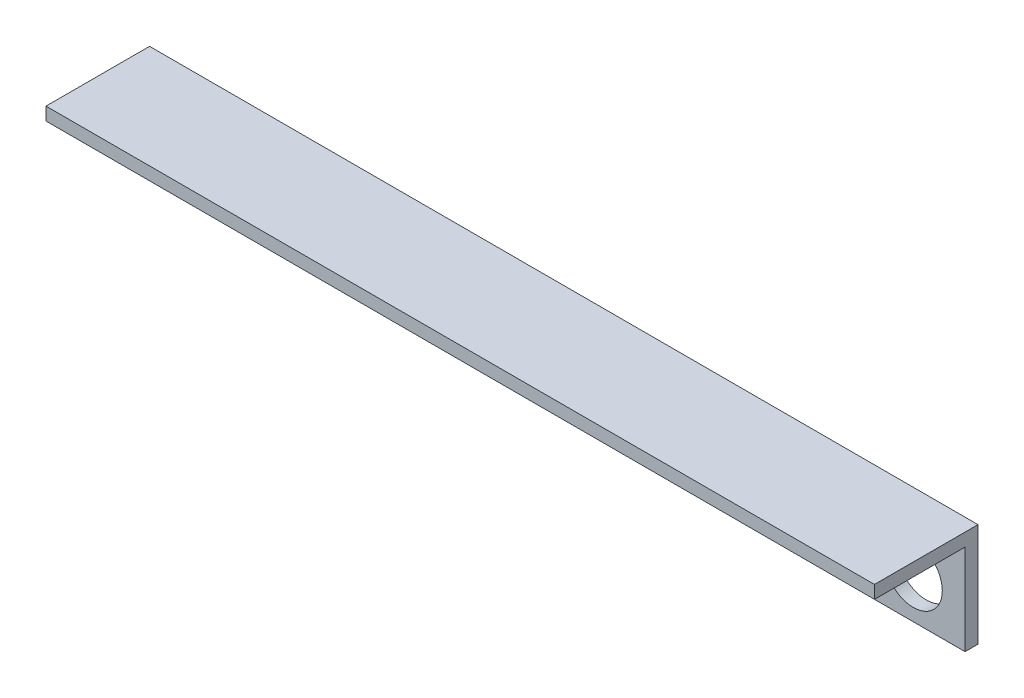
ISO-10303-21;
HEADER;
FILE_DESCRIPTION(('STEP AP214'),'2;1');
FILE_NAME('part.step','',(''),(''),'','','');
FILE_SCHEMA(('AUTOMOTIVE_DESIGN { 1 0 10303 214 1 1 1 1 }'));
ENDSEC;
DATA;
#1=APPLICATION_CONTEXT('core data for automotive mechanical design processes');
#2=APPLICATION_PROTOCOL_DEFINITION('international standard','automotive_design',2000,#1);
#3=PRODUCT_CONTEXT('',#1,'mechanical');
#4=PRODUCT('Part','Part','',(#3));
#5=PRODUCT_RELATED_PRODUCT_CATEGORY('part','',(#4));
#6=PRODUCT_DEFINITION_FORMATION('','',#4);
#7=PRODUCT_DEFINITION_CONTEXT('part definition',#1,'design');
#8=PRODUCT_DEFINITION('design','',#6,#7);
#9=PRODUCT_DEFINITION_SHAPE('','',#8);
#10=(LENGTH_UNIT() NAMED_UNIT(*) SI_UNIT(.MILLI.,.METRE.));
#11=(NAMED_UNIT(*) PLANE_ANGLE_UNIT() SI_UNIT($,.RADIAN.));
#12=(NAMED_UNIT(*) SI_UNIT($,.STERADIAN.) SOLID_ANGLE_UNIT());
#13=UNCERTAINTY_MEASURE_WITH_UNIT(LENGTH_MEASURE(1.E-05),#10,'distance_accuracy_value','');
#14=(GEOMETRIC_REPRESENTATION_CONTEXT(3) GLOBAL_UNCERTAINTY_ASSIGNED_CONTEXT((#13)) GLOBAL_UNIT_ASSIGNED_CONTEXT((#10,
#11,#12)) REPRESENTATION_CONTEXT('',''));
#15=CARTESIAN_POINT('',(0.,0.,0.));
#16=DIRECTION('',(0.,0.,1.));
#17=DIRECTION('',(1.,0.,0.));
#18=AXIS2_PLACEMENT_3D('',#15,#16,#17);
#19=CARTESIAN_POINT('',(-44.45,0.,1.5875));
#20=DIRECTION('',(0.,-1.,0.));
#21=DIRECTION('',(0.,0.,-1.));
#22=AXIS2_PLACEMENT_3D('',#19,#20,#21);
#23=PLANE('',#22);
#24=DIRECTION('',(1.,0.,0.));
#25=VECTOR('',#24,1.);
#26=CARTESIAN_POINT('',(-44.45,0.,0.));
#27=LINE('',#26,#25);
#28=CARTESIAN_POINT('',(-44.45,0.,0.));
#29=VERTEX_POINT('',#28);
#30=CARTESIAN_POINT('',(57.15,0.,0.));
#31=VERTEX_POINT('',#30);
#32=EDGE_CURVE('E41',#29,#31,#27,.T.);
#33=ORIENTED_EDGE('',*,*,#32,.T.);
#34=DIRECTION('',(0.,0.,-1.));
#35=VECTOR('',#34,1.);
#36=CARTESIAN_POINT('',(57.15,0.,1.5875));
#37=LINE('',#36,#35);
#38=CARTESIAN_POINT('',(57.15,0.,1.5875));
#39=VERTEX_POINT('',#38);
#40=EDGE_CURVE('E90',#39,#31,#37,.T.);
#41=ORIENTED_EDGE('',*,*,#40,.F.);
#42=DIRECTION('',(1.,0.,0.));
#43=VECTOR('',#42,1.);
#44=CARTESIAN_POINT('',(-44.45,0.,1.5875));
#45=LINE('',#44,#43);
#46=CARTESIAN_POINT('',(-44.45,0.,1.5875));
#47=VERTEX_POINT('',#46);
#48=EDGE_CURVE('E11',#47,#39,#45,.T.);
#49=ORIENTED_EDGE('',*,*,#48,.F.);
#50=DIRECTION('',(0.,0.,-1.));
#51=VECTOR('',#50,1.);
#52=CARTESIAN_POINT('',(-44.45,0.,1.5875));
#53=LINE('',#52,#51);
#54=EDGE_CURVE('E91',#47,#29,#53,.T.);
#55=ORIENTED_EDGE('',*,*,#54,.T.);
#56=EDGE_LOOP('',(#33,#41,#49,#55));
#57=FACE_BOUND('',#56,.T.);
#58=ADVANCED_FACE('F38',(#57),#23,.T.);
#59=CARTESIAN_POINT('',(-44.45,0.,1.5875));
#60=DIRECTION('',(0.,0.,1.));
#61=DIRECTION('',(1.,0.,0.));
#62=AXIS2_PLACEMENT_3D('',#59,#60,#61);
#63=PLANE('',#62);
#64=CARTESIAN_POINT('',(-25.4,5.08000000000001,1.5875));
#65=DIRECTION('',(0.,0.,1.));
#66=DIRECTION('',(1.,0.,0.));
#67=AXIS2_PLACEMENT_3D('',#64,#65,#66);
#68=CIRCLE('',#67,3.556);
#69=CARTESIAN_POINT('',(-21.844,5.08000000000001,1.5875));
#70=VERTEX_POINT('',#69);
#71=EDGE_CURVE('E109',#70,#70,#68,.T.);
#72=ORIENTED_EDGE('',*,*,#71,.F.);
#73=EDGE_LOOP('',(#72));
#74=FACE_BOUND('',#73,.T.);
#75=CARTESIAN_POINT('',(50.8,5.08,1.5875));
#76=DIRECTION('',(0.,0.,1.));
#77=DIRECTION('',(1.,0.,0.));
#78=AXIS2_PLACEMENT_3D('',#75,#76,#77);
#79=CIRCLE('',#78,3.556);
#80=CARTESIAN_POINT('',(54.356,5.08,1.5875));
#81=VERTEX_POINT('',#80);
#82=EDGE_CURVE('E112',#81,#81,#79,.T.);
#83=ORIENTED_EDGE('',*,*,#82,.F.);
#84=EDGE_LOOP('',(#83));
#85=FACE_BOUND('',#84,.T.);
#86=ORIENTED_EDGE('',*,*,#48,.T.);
#87=DIRECTION('',(0.,-1.,0.));
#88=VECTOR('',#87,1.);
#89=CARTESIAN_POINT('',(57.15,0.,1.5875));
#90=LINE('',#89,#88);
#91=CARTESIAN_POINT('',(57.15,11.1125,1.5875));
#92=VERTEX_POINT('',#91);
#93=EDGE_CURVE('E108',#92,#39,#90,.T.);
#94=ORIENTED_EDGE('',*,*,#93,.F.);
#95=DIRECTION('',(1.,0.,0.));
#96=VECTOR('',#95,1.);
#97=CARTESIAN_POINT('',(-44.45,11.1125,1.5875));
#98=LINE('',#97,#96);
#99=CARTESIAN_POINT('',(-44.45,11.1125,1.5875));
#100=VERTEX_POINT('',#99);
#101=EDGE_CURVE('E46',#100,#92,#98,.T.);
#102=ORIENTED_EDGE('',*,*,#101,.F.);
#103=DIRECTION('',(0.,-1.,0.));
#104=VECTOR('',#103,1.);
#105=CARTESIAN_POINT('',(-44.45,0.,1.5875));
#106=LINE('',#105,#104);
#107=EDGE_CURVE('E96',#100,#47,#106,.T.);
#108=ORIENTED_EDGE('',*,*,#107,.T.);
#109=EDGE_LOOP('',(#86,#94,#102,#108));
#110=FACE_BOUND('',#109,.T.);
#111=ADVANCED_FACE('F153',(#74,#85,#110),#63,.T.);
#112=CARTESIAN_POINT('',(-44.45,11.1125,1.5875));
#113=DIRECTION('',(0.,-1.,0.));
#114=DIRECTION('',(0.,0.,-1.));
#115=AXIS2_PLACEMENT_3D('',#112,#113,#114);
#116=PLANE('',#115);
#117=ORIENTED_EDGE('',*,*,#101,.T.);
#118=DIRECTION('',(0.,0.,-1.));
#119=VECTOR('',#118,1.);
#120=CARTESIAN_POINT('',(57.15,11.1125,1.5875));
#121=LINE('',#120,#119);
#122=CARTESIAN_POINT('',(57.15,11.1125,12.7));
#123=VERTEX_POINT('',#122);
#124=EDGE_CURVE('E120',#123,#92,#121,.T.);
#125=ORIENTED_EDGE('',*,*,#124,.F.);
#126=DIRECTION('',(1.,0.,0.));
#127=VECTOR('',#126,1.);
#128=CARTESIAN_POINT('',(-44.45,11.1125,12.7));
#129=LINE('',#128,#127);
#130=CARTESIAN_POINT('',(-44.45,11.1125,12.7));
#131=VERTEX_POINT('',#130);
#132=EDGE_CURVE('E136',#131,#123,#129,.T.);
#133=ORIENTED_EDGE('',*,*,#132,.F.);
#134=DIRECTION('',(0.,0.,-1.));
#135=VECTOR('',#134,1.);
#136=CARTESIAN_POINT('',(-44.45,11.1125,1.5875));
#137=LINE('',#136,#135);
#138=EDGE_CURVE('E132',#131,#100,#137,.T.);
#139=ORIENTED_EDGE('',*,*,#138,.T.);
#140=EDGE_LOOP('',(#117,#125,#133,#139));
#141=FACE_BOUND('',#140,.T.);
#142=ADVANCED_FACE('F149',(#141),#116,.T.);
#143=CARTESIAN_POINT('',(-44.45,11.1125,12.7));
#144=DIRECTION('',(0.,0.,1.));
#145=DIRECTION('',(1.,0.,0.));
#146=AXIS2_PLACEMENT_3D('',#143,#144,#145);
#147=PLANE('',#146);
#148=ORIENTED_EDGE('',*,*,#132,.T.);
#149=DIRECTION('',(0.,-1.,0.));
#150=VECTOR('',#149,1.);
#151=CARTESIAN_POINT('',(57.15,11.1125,12.7));
#152=LINE('',#151,#150);
#153=CARTESIAN_POINT('',(57.15,12.7,12.7));
#154=VERTEX_POINT('',#153);
#155=EDGE_CURVE('E117',#154,#123,#152,.T.);
#156=ORIENTED_EDGE('',*,*,#155,.F.);
#157=DIRECTION('',(1.,0.,0.));
#158=VECTOR('',#157,1.);
#159=CARTESIAN_POINT('',(-44.45,12.7,12.7));
#160=LINE('',#159,#158);
#161=CARTESIAN_POINT('',(-44.45,12.7,12.7));
#162=VERTEX_POINT('',#161);
#163=EDGE_CURVE('E138',#162,#154,#160,.T.);
#164=ORIENTED_EDGE('',*,*,#163,.F.);
#165=DIRECTION('',(0.,-1.,0.));
#166=VECTOR('',#165,1.);
#167=CARTESIAN_POINT('',(-44.45,11.1125,12.7));
#168=LINE('',#167,#166);
#169=EDGE_CURVE('E129',#162,#131,#168,.T.);
#170=ORIENTED_EDGE('',*,*,#169,.T.);
#171=EDGE_LOOP('',(#148,#156,#164,#170));
#172=FACE_BOUND('',#171,.T.);
#173=ADVANCED_FACE('F146',(#172),#147,.T.);
#174=CARTESIAN_POINT('',(-44.45,12.7,0.));
#175=DIRECTION('',(0.,1.,0.));
#176=DIRECTION('',(0.,0.,1.));
#177=AXIS2_PLACEMENT_3D('',#174,#175,#176);
#178=PLANE('',#177);
#179=ORIENTED_EDGE('',*,*,#163,.T.);
#180=DIRECTION('',(0.,0.,1.));
#181=VECTOR('',#180,1.);
#182=CARTESIAN_POINT('',(57.15,12.7,0.));
#183=LINE('',#182,#181);
#184=CARTESIAN_POINT('',(57.15,12.7,0.));
#185=VERTEX_POINT('',#184);
#186=EDGE_CURVE('E103',#185,#154,#183,.T.);
#187=ORIENTED_EDGE('',*,*,#186,.F.);
#188=DIRECTION('',(1.,0.,0.));
#189=VECTOR('',#188,1.);
#190=CARTESIAN_POINT('',(-44.45,12.7,0.));
#191=LINE('',#190,#189);
#192=CARTESIAN_POINT('',(-44.45,12.7,0.));
#193=VERTEX_POINT('',#192);
#194=EDGE_CURVE('E95',#193,#185,#191,.T.);
#195=ORIENTED_EDGE('',*,*,#194,.F.);
#196=DIRECTION('',(0.,0.,1.));
#197=VECTOR('',#196,1.);
#198=CARTESIAN_POINT('',(-44.45,12.7,0.));
#199=LINE('',#198,#197);
#200=EDGE_CURVE('E126',#193,#162,#199,.T.);
#201=ORIENTED_EDGE('',*,*,#200,.T.);
#202=EDGE_LOOP('',(#179,#187,#195,#201));
#203=FACE_BOUND('',#202,.T.);
#204=ADVANCED_FACE('F140',(#203),#178,.T.);
#205=CARTESIAN_POINT('',(-44.45,0.,0.));
#206=DIRECTION('',(0.,0.,-1.));
#207=DIRECTION('',(-1.,0.,0.));
#208=AXIS2_PLACEMENT_3D('',#205,#206,#207);
#209=PLANE('',#208);
#210=CARTESIAN_POINT('',(-25.4,5.08000000000001,0.));
#211=DIRECTION('',(0.,0.,-1.));
#212=DIRECTION('',(-1.,0.,0.));
#213=AXIS2_PLACEMENT_3D('',#210,#211,#212);
#214=CIRCLE('',#213,3.556);
#215=CARTESIAN_POINT('',(-28.956,5.08000000000001,0.));
#216=VERTEX_POINT('',#215);
#217=EDGE_CURVE('E178',#216,#216,#214,.T.);
#218=ORIENTED_EDGE('',*,*,#217,.F.);
#219=EDGE_LOOP('',(#218));
#220=FACE_BOUND('',#219,.T.);
#221=CARTESIAN_POINT('',(50.8,5.08,0.));
#222=DIRECTION('',(0.,0.,-1.));
#223=DIRECTION('',(-1.,0.,0.));
#224=AXIS2_PLACEMENT_3D('',#221,#222,#223);
#225=CIRCLE('',#224,3.556);
#226=CARTESIAN_POINT('',(47.244,5.08,0.));
#227=VERTEX_POINT('',#226);
#228=EDGE_CURVE('E181',#227,#227,#225,.T.);
#229=ORIENTED_EDGE('',*,*,#228,.F.);
#230=EDGE_LOOP('',(#229));
#231=FACE_BOUND('',#230,.T.);
#232=ORIENTED_EDGE('',*,*,#194,.T.);
#233=DIRECTION('',(0.,1.,0.));
#234=VECTOR('',#233,1.);
#235=CARTESIAN_POINT('',(57.15,0.,0.));
#236=LINE('',#235,#234);
#237=EDGE_CURVE('E98',#31,#185,#236,.T.);
#238=ORIENTED_EDGE('',*,*,#237,.F.);
#239=ORIENTED_EDGE('',*,*,#32,.F.);
#240=DIRECTION('',(0.,1.,0.));
#241=VECTOR('',#240,1.);
#242=CARTESIAN_POINT('',(-44.45,0.,0.));
#243=LINE('',#242,#241);
#244=EDGE_CURVE('E124',#29,#193,#243,.T.);
#245=ORIENTED_EDGE('',*,*,#244,.T.);
#246=EDGE_LOOP('',(#232,#238,#239,#245));
#247=FACE_BOUND('',#246,.T.);
#248=ADVANCED_FACE('F99',(#220,#231,#247),#209,.T.);
#249=CARTESIAN_POINT('',(-44.45,0.,0.));
#250=DIRECTION('',(1.,0.,0.));
#251=DIRECTION('',(0.,0.,-1.));
#252=AXIS2_PLACEMENT_3D('',#249,#250,#251);
#253=PLANE('',#252);
#254=ORIENTED_EDGE('',*,*,#54,.F.);
#255=ORIENTED_EDGE('',*,*,#107,.F.);
#256=ORIENTED_EDGE('',*,*,#138,.F.);
#257=ORIENTED_EDGE('',*,*,#169,.F.);
#258=ORIENTED_EDGE('',*,*,#200,.F.);
#259=ORIENTED_EDGE('',*,*,#244,.F.);
#260=EDGE_LOOP('',(#254,#255,#256,#257,#258,#259));
#261=FACE_BOUND('',#260,.T.);
#262=ADVANCED_FACE('F152',(#261),#253,.F.);
#263=CARTESIAN_POINT('',(57.15,0.,0.));
#264=DIRECTION('',(1.,0.,0.));
#265=DIRECTION('',(0.,0.,-1.));
#266=AXIS2_PLACEMENT_3D('',#263,#264,#265);
#267=PLANE('',#266);
#268=ORIENTED_EDGE('',*,*,#40,.T.);
#269=ORIENTED_EDGE('',*,*,#237,.T.);
#270=ORIENTED_EDGE('',*,*,#186,.T.);
#271=ORIENTED_EDGE('',*,*,#155,.T.);
#272=ORIENTED_EDGE('',*,*,#124,.T.);
#273=ORIENTED_EDGE('',*,*,#93,.T.);
#274=EDGE_LOOP('',(#268,#269,#270,#271,#272,#273));
#275=FACE_BOUND('',#274,.T.);
#276=ADVANCED_FACE('F106',(#275),#267,.T.);
#277=CARTESIAN_POINT('',(50.8,5.08,12.7));
#278=DIRECTION('',(0.,0.,-1.));
#279=DIRECTION('',(-1.,0.,0.));
#280=AXIS2_PLACEMENT_3D('',#277,#278,#279);
#281=CYLINDRICAL_SURFACE('',#280,3.556);
#282=ORIENTED_EDGE('',*,*,#82,.T.);
#283=EDGE_LOOP('',(#282));
#284=FACE_BOUND('',#283,.T.);
#285=ORIENTED_EDGE('',*,*,#228,.T.);
#286=EDGE_LOOP('',(#285));
#287=FACE_BOUND('',#286,.T.);
#288=ADVANCED_FACE('F188',(#284,#287),#281,.F.);
#289=CARTESIAN_POINT('',(-25.4,5.08000000000001,12.7));
#290=DIRECTION('',(0.,0.,-1.));
#291=DIRECTION('',(-1.,0.,0.));
#292=AXIS2_PLACEMENT_3D('',#289,#290,#291);
#293=CYLINDRICAL_SURFACE('',#292,3.556);
#294=ORIENTED_EDGE('',*,*,#71,.T.);
#295=EDGE_LOOP('',(#294));
#296=FACE_BOUND('',#295,.T.);
#297=ORIENTED_EDGE('',*,*,#217,.T.);
#298=EDGE_LOOP('',(#297));
#299=FACE_BOUND('',#298,.T.);
#300=ADVANCED_FACE('F190',(#296,#299),#293,.F.);
#301=CLOSED_SHELL('',(#58,#111,#142,#173,#204,#248,#262,#276,#288,#300));
#302=MANIFOLD_SOLID_BREP('B2',#301);
#303=ADVANCED_BREP_SHAPE_REPRESENTATION('',(#18,#302),#14);
#304=SHAPE_DEFINITION_REPRESENTATION(#9,#303);
ENDSEC;
END-ISO-10303-21;
